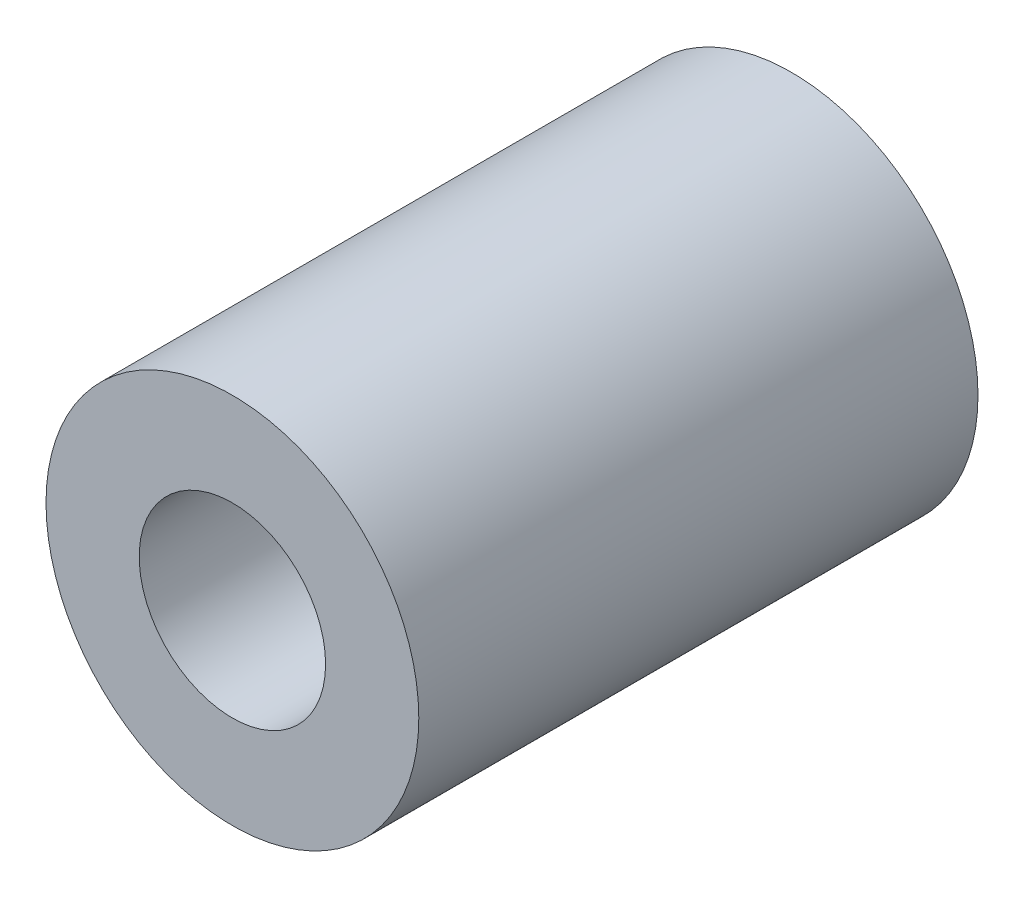
ISO-10303-21;
HEADER;
FILE_DESCRIPTION(('STEP AP214'),'2;1');
FILE_NAME('part.step','',(''),(''),'','','');
FILE_SCHEMA(('AUTOMOTIVE_DESIGN { 1 0 10303 214 1 1 1 1 }'));
ENDSEC;
DATA;
#1=APPLICATION_CONTEXT('core data for automotive mechanical design processes');
#2=APPLICATION_PROTOCOL_DEFINITION('international standard','automotive_design',2000,#1);
#3=PRODUCT_CONTEXT('',#1,'mechanical');
#4=PRODUCT('Part','Part','',(#3));
#5=PRODUCT_RELATED_PRODUCT_CATEGORY('part','',(#4));
#6=PRODUCT_DEFINITION_FORMATION('','',#4);
#7=PRODUCT_DEFINITION_CONTEXT('part definition',#1,'design');
#8=PRODUCT_DEFINITION('design','',#6,#7);
#9=PRODUCT_DEFINITION_SHAPE('','',#8);
#10=(LENGTH_UNIT() NAMED_UNIT(*) SI_UNIT(.MILLI.,.METRE.));
#11=(NAMED_UNIT(*) PLANE_ANGLE_UNIT() SI_UNIT($,.RADIAN.));
#12=(NAMED_UNIT(*) SI_UNIT($,.STERADIAN.) SOLID_ANGLE_UNIT());
#13=UNCERTAINTY_MEASURE_WITH_UNIT(LENGTH_MEASURE(1.E-05),#10,'distance_accuracy_value','');
#14=(GEOMETRIC_REPRESENTATION_CONTEXT(3) GLOBAL_UNCERTAINTY_ASSIGNED_CONTEXT((#13)) GLOBAL_UNIT_ASSIGNED_CONTEXT((#10,
#11,#12)) REPRESENTATION_CONTEXT('',''));
#15=CARTESIAN_POINT('',(0.,0.,0.));
#16=DIRECTION('',(0.,0.,1.));
#17=DIRECTION('',(1.,0.,0.));
#18=AXIS2_PLACEMENT_3D('',#15,#16,#17);
#19=CARTESIAN_POINT('',(0.,0.,9.));
#20=DIRECTION('',(0.,0.,1.));
#21=DIRECTION('',(1.,0.,0.));
#22=AXIS2_PLACEMENT_3D('',#19,#20,#21);
#23=PLANE('',#22);
#24=CARTESIAN_POINT('',(0.,0.,9.));
#25=DIRECTION('',(0.,0.,1.));
#26=DIRECTION('',(1.,0.,0.));
#27=AXIS2_PLACEMENT_3D('',#24,#25,#26);
#28=CIRCLE('',#27,3.);
#29=CARTESIAN_POINT('',(3.,0.,9.));
#30=VERTEX_POINT('',#29);
#31=EDGE_CURVE('E11',#30,#30,#28,.T.);
#32=ORIENTED_EDGE('',*,*,#31,.T.);
#33=EDGE_LOOP('',(#32));
#34=FACE_BOUND('',#33,.T.);
#35=CARTESIAN_POINT('',(0.,0.,9.));
#36=DIRECTION('',(0.,0.,1.));
#37=DIRECTION('',(1.,0.,0.));
#38=AXIS2_PLACEMENT_3D('',#35,#36,#37);
#39=CIRCLE('',#38,1.5);
#40=CARTESIAN_POINT('',(1.5,0.,9.));
#41=VERTEX_POINT('',#40);
#42=EDGE_CURVE('E48',#41,#41,#39,.T.);
#43=ORIENTED_EDGE('',*,*,#42,.F.);
#44=EDGE_LOOP('',(#43));
#45=FACE_BOUND('',#44,.T.);
#46=ADVANCED_FACE('F37',(#34,#45),#23,.T.);
#47=CARTESIAN_POINT('',(0.,0.,0.));
#48=DIRECTION('',(0.,0.,1.));
#49=DIRECTION('',(1.,0.,0.));
#50=AXIS2_PLACEMENT_3D('',#47,#48,#49);
#51=PLANE('',#50);
#52=CARTESIAN_POINT('',(0.,0.,0.));
#53=DIRECTION('',(0.,0.,1.));
#54=DIRECTION('',(1.,0.,0.));
#55=AXIS2_PLACEMENT_3D('',#52,#53,#54);
#56=CIRCLE('',#55,3.);
#57=CARTESIAN_POINT('',(3.,0.,0.));
#58=VERTEX_POINT('',#57);
#59=EDGE_CURVE('E41',#58,#58,#56,.T.);
#60=ORIENTED_EDGE('',*,*,#59,.F.);
#61=EDGE_LOOP('',(#60));
#62=FACE_BOUND('',#61,.T.);
#63=CARTESIAN_POINT('',(0.,0.,0.));
#64=DIRECTION('',(0.,0.,1.));
#65=DIRECTION('',(1.,0.,0.));
#66=AXIS2_PLACEMENT_3D('',#63,#64,#65);
#67=CIRCLE('',#66,1.5);
#68=CARTESIAN_POINT('',(1.5,0.,0.));
#69=VERTEX_POINT('',#68);
#70=EDGE_CURVE('E50',#69,#69,#67,.T.);
#71=ORIENTED_EDGE('',*,*,#70,.T.);
#72=EDGE_LOOP('',(#71));
#73=FACE_BOUND('',#72,.T.);
#74=ADVANCED_FACE('F60',(#62,#73),#51,.F.);
#75=CARTESIAN_POINT('',(0.,0.,9.));
#76=DIRECTION('',(0.,0.,-1.));
#77=DIRECTION('',(-1.,0.,0.));
#78=AXIS2_PLACEMENT_3D('',#75,#76,#77);
#79=CYLINDRICAL_SURFACE('',#78,3.);
#80=ORIENTED_EDGE('',*,*,#31,.F.);
#81=EDGE_LOOP('',(#80));
#82=FACE_BOUND('',#81,.T.);
#83=ORIENTED_EDGE('',*,*,#59,.T.);
#84=EDGE_LOOP('',(#83));
#85=FACE_BOUND('',#84,.T.);
#86=ADVANCED_FACE('F39',(#82,#85),#79,.T.);
#87=CARTESIAN_POINT('',(0.,0.,9.));
#88=DIRECTION('',(0.,0.,-1.));
#89=DIRECTION('',(-1.,0.,0.));
#90=AXIS2_PLACEMENT_3D('',#87,#88,#89);
#91=CYLINDRICAL_SURFACE('',#90,1.5);
#92=ORIENTED_EDGE('',*,*,#42,.T.);
#93=EDGE_LOOP('',(#92));
#94=FACE_BOUND('',#93,.T.);
#95=ORIENTED_EDGE('',*,*,#70,.F.);
#96=EDGE_LOOP('',(#95));
#97=FACE_BOUND('',#96,.T.);
#98=ADVANCED_FACE('F56',(#94,#97),#91,.F.);
#99=CLOSED_SHELL('',(#46,#74,#86,#98));
#100=MANIFOLD_SOLID_BREP('B2',#99);
#101=ADVANCED_BREP_SHAPE_REPRESENTATION('',(#18,#100),#14);
#102=SHAPE_DEFINITION_REPRESENTATION(#9,#101);
ENDSEC;
END-ISO-10303-21;
